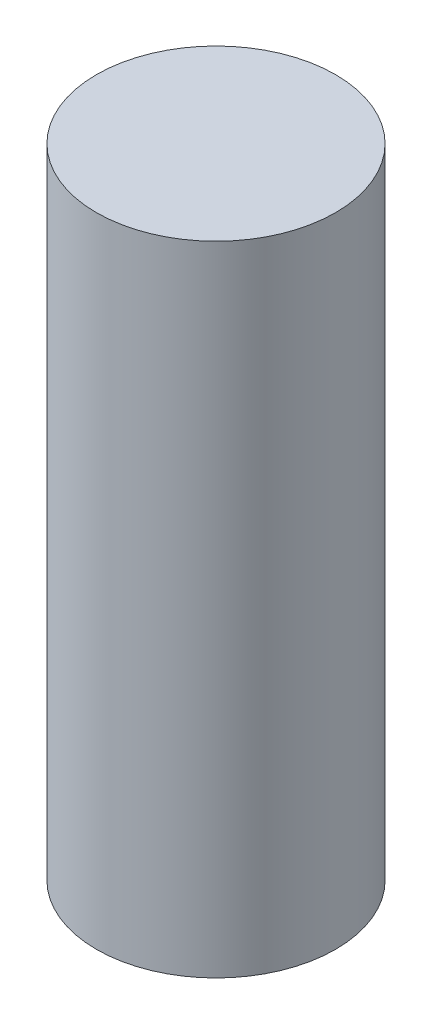
ISO-10303-21;
HEADER;
FILE_DESCRIPTION(('STEP AP214'),'2;1');
FILE_NAME('part.step','',(''),(''),'','','');
FILE_SCHEMA(('AUTOMOTIVE_DESIGN { 1 0 10303 214 1 1 1 1 }'));
ENDSEC;
DATA;
#1=APPLICATION_CONTEXT('core data for automotive mechanical design processes');
#2=APPLICATION_PROTOCOL_DEFINITION('international standard','automotive_design',2000,#1);
#3=PRODUCT_CONTEXT('',#1,'mechanical');
#4=PRODUCT('Part','Part','',(#3));
#5=PRODUCT_RELATED_PRODUCT_CATEGORY('part','',(#4));
#6=PRODUCT_DEFINITION_FORMATION('','',#4);
#7=PRODUCT_DEFINITION_CONTEXT('part definition',#1,'design');
#8=PRODUCT_DEFINITION('design','',#6,#7);
#9=PRODUCT_DEFINITION_SHAPE('','',#8);
#10=(LENGTH_UNIT() NAMED_UNIT(*) SI_UNIT(.MILLI.,.METRE.));
#11=(NAMED_UNIT(*) PLANE_ANGLE_UNIT() SI_UNIT($,.RADIAN.));
#12=(NAMED_UNIT(*) SI_UNIT($,.STERADIAN.) SOLID_ANGLE_UNIT());
#13=UNCERTAINTY_MEASURE_WITH_UNIT(LENGTH_MEASURE(1.E-05),#10,'distance_accuracy_value','');
#14=(GEOMETRIC_REPRESENTATION_CONTEXT(3) GLOBAL_UNCERTAINTY_ASSIGNED_CONTEXT((#13)) GLOBAL_UNIT_ASSIGNED_CONTEXT((#10,
#11,#12)) REPRESENTATION_CONTEXT('',''));
#15=CARTESIAN_POINT('',(0.,0.,0.));
#16=DIRECTION('',(0.,0.,1.));
#17=DIRECTION('',(1.,0.,0.));
#18=AXIS2_PLACEMENT_3D('',#15,#16,#17);
#19=CARTESIAN_POINT('',(0.,12.7,0.));
#20=DIRECTION('',(0.,-1.,0.));
#21=DIRECTION('',(0.,0.,-1.));
#22=AXIS2_PLACEMENT_3D('',#19,#20,#21);
#23=CYLINDRICAL_SURFACE('',#22,2.38);
#24=CARTESIAN_POINT('',(0.,12.7,0.));
#25=DIRECTION('',(0.,1.,0.));
#26=DIRECTION('',(0.,0.,1.));
#27=AXIS2_PLACEMENT_3D('',#24,#25,#26);
#28=CIRCLE('',#27,2.38);
#29=CARTESIAN_POINT('',(0.,12.7,2.38));
#30=VERTEX_POINT('',#29);
#31=EDGE_CURVE('E10',#30,#30,#28,.T.);
#32=ORIENTED_EDGE('',*,*,#31,.F.);
#33=EDGE_LOOP('',(#32));
#34=FACE_BOUND('',#33,.T.);
#35=CARTESIAN_POINT('',(0.,0.,0.));
#36=DIRECTION('',(0.,1.,0.));
#37=DIRECTION('',(0.,0.,1.));
#38=AXIS2_PLACEMENT_3D('',#35,#36,#37);
#39=CIRCLE('',#38,2.38);
#40=CARTESIAN_POINT('',(0.,0.,2.38));
#41=VERTEX_POINT('',#40);
#42=EDGE_CURVE('E41',#41,#41,#39,.T.);
#43=ORIENTED_EDGE('',*,*,#42,.T.);
#44=EDGE_LOOP('',(#43));
#45=FACE_BOUND('',#44,.T.);
#46=ADVANCED_FACE('F38',(#34,#45),#23,.T.);
#47=CARTESIAN_POINT('',(0.,12.7,0.));
#48=DIRECTION('',(0.,1.,0.));
#49=DIRECTION('',(0.,0.,1.));
#50=AXIS2_PLACEMENT_3D('',#47,#48,#49);
#51=PLANE('',#50);
#52=ORIENTED_EDGE('',*,*,#31,.T.);
#53=EDGE_LOOP('',(#52));
#54=FACE_BOUND('',#53,.T.);
#55=ADVANCED_FACE('F53',(#54),#51,.T.);
#56=CARTESIAN_POINT('',(0.,0.,0.));
#57=DIRECTION('',(0.,1.,0.));
#58=DIRECTION('',(0.,0.,1.));
#59=AXIS2_PLACEMENT_3D('',#56,#57,#58);
#60=PLANE('',#59);
#61=ORIENTED_EDGE('',*,*,#42,.F.);
#62=EDGE_LOOP('',(#61));
#63=FACE_BOUND('',#62,.T.);
#64=ADVANCED_FACE('F51',(#63),#60,.F.);
#65=CLOSED_SHELL('',(#46,#55,#64));
#66=MANIFOLD_SOLID_BREP('B2',#65);
#67=ADVANCED_BREP_SHAPE_REPRESENTATION('',(#18,#66),#14);
#68=SHAPE_DEFINITION_REPRESENTATION(#9,#67);
ENDSEC;
END-ISO-10303-21;
